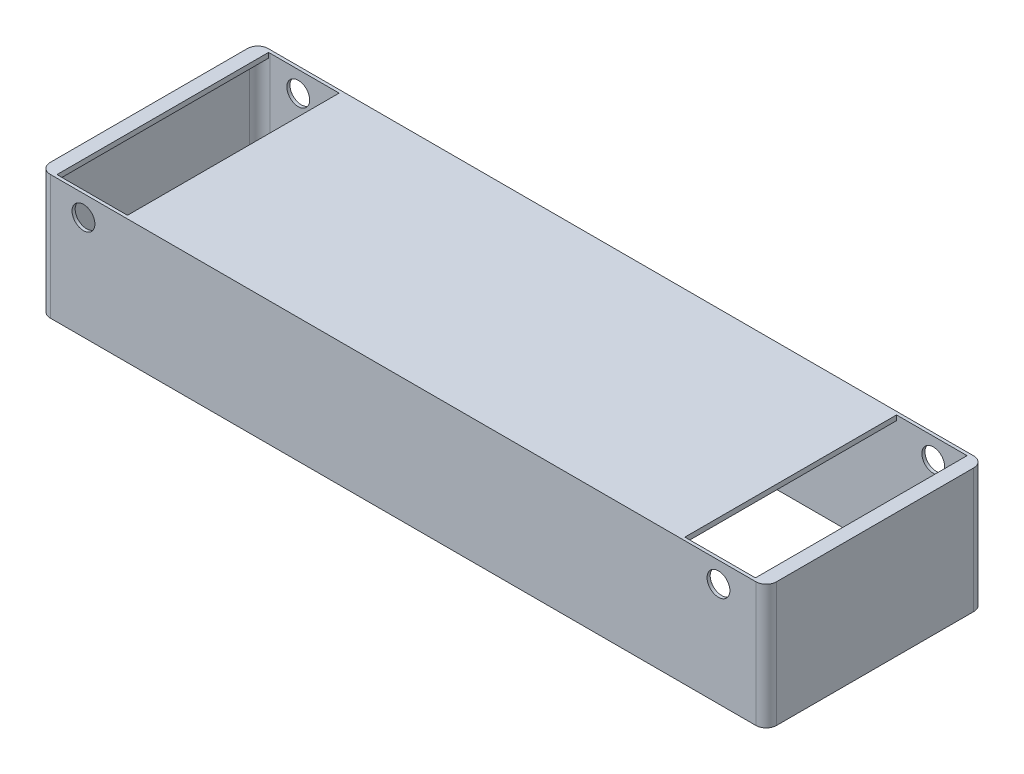
ISO-10303-21;
HEADER;
FILE_DESCRIPTION(('STEP AP214'),'2;1');
FILE_NAME('part.step','',(''),(''),'','','');
FILE_SCHEMA(('AUTOMOTIVE_DESIGN { 1 0 10303 214 1 1 1 1 }'));
ENDSEC;
DATA;
#1=APPLICATION_CONTEXT('core data for automotive mechanical design processes');
#2=APPLICATION_PROTOCOL_DEFINITION('international standard','automotive_design',2000,#1);
#3=PRODUCT_CONTEXT('',#1,'mechanical');
#4=PRODUCT('Part','Part','',(#3));
#5=PRODUCT_RELATED_PRODUCT_CATEGORY('part','',(#4));
#6=PRODUCT_DEFINITION_FORMATION('','',#4);
#7=PRODUCT_DEFINITION_CONTEXT('part definition',#1,'design');
#8=PRODUCT_DEFINITION('design','',#6,#7);
#9=PRODUCT_DEFINITION_SHAPE('','',#8);
#10=(LENGTH_UNIT() NAMED_UNIT(*) SI_UNIT(.MILLI.,.METRE.));
#11=(NAMED_UNIT(*) PLANE_ANGLE_UNIT() SI_UNIT($,.RADIAN.));
#12=(NAMED_UNIT(*) SI_UNIT($,.STERADIAN.) SOLID_ANGLE_UNIT());
#13=UNCERTAINTY_MEASURE_WITH_UNIT(LENGTH_MEASURE(1.E-05),#10,'distance_accuracy_value','');
#14=(GEOMETRIC_REPRESENTATION_CONTEXT(3) GLOBAL_UNCERTAINTY_ASSIGNED_CONTEXT((#13)) GLOBAL_UNIT_ASSIGNED_CONTEXT((#10,
#11,#12)) REPRESENTATION_CONTEXT('',''));
#15=CARTESIAN_POINT('',(0.,0.,0.));
#16=DIRECTION('',(0.,0.,1.));
#17=DIRECTION('',(1.,0.,0.));
#18=AXIS2_PLACEMENT_3D('',#15,#16,#17);
#19=CARTESIAN_POINT('',(-172.6,60.,-46.));
#20=DIRECTION('',(1.,0.,0.));
#21=DIRECTION('',(0.,0.,-1.));
#22=AXIS2_PLACEMENT_3D('',#19,#20,#21);
#23=PLANE('',#22);
#24=DIRECTION('',(0.,-1.,0.));
#25=VECTOR('',#24,1.);
#26=CARTESIAN_POINT('',(-172.6,60.,-46.));
#27=LINE('',#26,#25);
#28=CARTESIAN_POINT('',(-172.6,57.6,-46.));
#29=VERTEX_POINT('',#28);
#30=CARTESIAN_POINT('',(-172.6,0.,-46.));
#31=VERTEX_POINT('',#30);
#32=EDGE_CURVE('E299',#29,#31,#27,.T.);
#33=ORIENTED_EDGE('',*,*,#32,.F.);
#34=DIRECTION('',(0.,0.,1.));
#35=VECTOR('',#34,1.);
#36=CARTESIAN_POINT('',(-172.6,57.6,-46.));
#37=LINE('',#36,#35);
#38=CARTESIAN_POINT('',(-172.6,57.6,45.9999999999999));
#39=VERTEX_POINT('',#38);
#40=EDGE_CURVE('E251',#29,#39,#37,.T.);
#41=ORIENTED_EDGE('',*,*,#40,.T.);
#42=DIRECTION('',(0.,-1.,0.));
#43=VECTOR('',#42,1.);
#44=CARTESIAN_POINT('',(-172.6,60.,45.9999999999999));
#45=LINE('',#44,#43);
#46=CARTESIAN_POINT('',(-172.6,0.,45.9999999999999));
#47=VERTEX_POINT('',#46);
#48=EDGE_CURVE('E297',#39,#47,#45,.T.);
#49=ORIENTED_EDGE('',*,*,#48,.T.);
#50=DIRECTION('',(0.,0.,1.));
#51=VECTOR('',#50,1.);
#52=CARTESIAN_POINT('',(-172.6,0.,-46.));
#53=LINE('',#52,#51);
#54=EDGE_CURVE('E286',#31,#47,#53,.T.);
#55=ORIENTED_EDGE('',*,*,#54,.F.);
#56=EDGE_LOOP('',(#33,#41,#49,#55));
#57=FACE_BOUND('',#56,.T.);
#58=ADVANCED_FACE('F33',(#57),#23,.T.);
#59=CARTESIAN_POINT('',(170.,60.,47.5));
#60=DIRECTION('',(0.,1.,0.));
#61=DIRECTION('',(0.,0.,1.));
#62=AXIS2_PLACEMENT_3D('',#59,#60,#61);
#63=PLANE('',#62);
#64=DIRECTION('',(1.,0.,0.));
#65=VECTOR('',#64,1.);
#66=CARTESIAN_POINT('',(-167.6,60.,51.));
#67=LINE('',#66,#65);
#68=CARTESIAN_POINT('',(134.3,60.,51.));
#69=VERTEX_POINT('',#68);
#70=CARTESIAN_POINT('',(167.6,60.,51.));
#71=VERTEX_POINT('',#70);
#72=EDGE_CURVE('E195',#69,#71,#67,.T.);
#73=ORIENTED_EDGE('',*,*,#72,.F.);
#74=DIRECTION('',(0.,0.,-1.));
#75=VECTOR('',#74,1.);
#76=CARTESIAN_POINT('',(134.3,60.,-52.5));
#77=LINE('',#76,#75);
#78=CARTESIAN_POINT('',(134.3,60.,-51.));
#79=VERTEX_POINT('',#78);
#80=EDGE_CURVE('E201',#69,#79,#77,.T.);
#81=ORIENTED_EDGE('',*,*,#80,.T.);
#82=DIRECTION('',(-1.,0.,0.));
#83=VECTOR('',#82,1.);
#84=CARTESIAN_POINT('',(-167.6,60.,-51.));
#85=LINE('',#84,#83);
#86=CARTESIAN_POINT('',(167.6,60.,-51.));
#87=VERTEX_POINT('',#86);
#88=EDGE_CURVE('E266',#87,#79,#85,.T.);
#89=ORIENTED_EDGE('',*,*,#88,.F.);
#90=CARTESIAN_POINT('',(167.6,60.,-46.));
#91=DIRECTION('',(0.,1.,0.));
#92=DIRECTION('',(0.,0.,-1.));
#93=AXIS2_PLACEMENT_3D('',#90,#91,#92);
#94=CIRCLE('',#93,5.);
#95=CARTESIAN_POINT('',(168.3,60.,-50.9507575177946));
#96=VERTEX_POINT('',#95);
#97=EDGE_CURVE('E262',#96,#87,#94,.T.);
#98=ORIENTED_EDGE('',*,*,#97,.F.);
#99=DIRECTION('',(0.,0.,1.));
#100=VECTOR('',#99,1.);
#101=CARTESIAN_POINT('',(168.3,60.,-52.4999999999991));
#102=LINE('',#101,#100);
#103=CARTESIAN_POINT('',(168.3,60.,50.9507575177947));
#104=VERTEX_POINT('',#103);
#105=EDGE_CURVE('E233',#96,#104,#102,.T.);
#106=ORIENTED_EDGE('',*,*,#105,.T.);
#107=CARTESIAN_POINT('',(167.6,60.,46.));
#108=DIRECTION('',(0.,1.,0.));
#109=DIRECTION('',(0.,0.,1.));
#110=AXIS2_PLACEMENT_3D('',#107,#108,#109);
#111=CIRCLE('',#110,5.);
#112=EDGE_CURVE('E203',#71,#104,#111,.T.);
#113=ORIENTED_EDGE('',*,*,#112,.F.);
#114=EDGE_LOOP('',(#73,#81,#89,#98,#106,#113));
#115=FACE_BOUND('',#114,.T.);
#116=CARTESIAN_POINT('',(-134.3,60.,-51.));
#117=VERTEX_POINT('',#116);
#118=CARTESIAN_POINT('',(-167.6,60.,-51.));
#119=VERTEX_POINT('',#118);
#120=EDGE_CURVE('E265',#117,#119,#85,.T.);
#121=ORIENTED_EDGE('',*,*,#120,.F.);
#122=DIRECTION('',(0.,0.,1.));
#123=VECTOR('',#122,1.);
#124=CARTESIAN_POINT('',(-134.3,60.,-52.5));
#125=LINE('',#124,#123);
#126=CARTESIAN_POINT('',(-134.3,60.,51.));
#127=VERTEX_POINT('',#126);
#128=EDGE_CURVE('E217',#117,#127,#125,.T.);
#129=ORIENTED_EDGE('',*,*,#128,.T.);
#130=CARTESIAN_POINT('',(-167.6,60.,51.));
#131=VERTEX_POINT('',#130);
#132=EDGE_CURVE('E207',#131,#127,#67,.T.);
#133=ORIENTED_EDGE('',*,*,#132,.F.);
#134=CARTESIAN_POINT('',(-167.6,60.,46.));
#135=DIRECTION('',(0.,1.,0.));
#136=DIRECTION('',(0.,0.,1.));
#137=AXIS2_PLACEMENT_3D('',#134,#135,#136);
#138=CIRCLE('',#137,5.);
#139=CARTESIAN_POINT('',(-168.3,60.,50.9507575177946));
#140=VERTEX_POINT('',#139);
#141=EDGE_CURVE('E208',#140,#131,#138,.T.);
#142=ORIENTED_EDGE('',*,*,#141,.F.);
#143=DIRECTION('',(0.,0.,-1.));
#144=VECTOR('',#143,1.);
#145=CARTESIAN_POINT('',(-168.3,60.,-52.5));
#146=LINE('',#145,#144);
#147=CARTESIAN_POINT('',(-168.3,60.,-50.9507575177946));
#148=VERTEX_POINT('',#147);
#149=EDGE_CURVE('E247',#140,#148,#146,.T.);
#150=ORIENTED_EDGE('',*,*,#149,.T.);
#151=CARTESIAN_POINT('',(-167.6,60.,-46.));
#152=DIRECTION('',(0.,1.,0.));
#153=DIRECTION('',(0.,0.,1.));
#154=AXIS2_PLACEMENT_3D('',#151,#152,#153);
#155=CIRCLE('',#154,5.);
#156=EDGE_CURVE('E268',#119,#148,#155,.T.);
#157=ORIENTED_EDGE('',*,*,#156,.F.);
#158=EDGE_LOOP('',(#121,#129,#133,#142,#150,#157));
#159=FACE_BOUND('',#158,.T.);
#160=DIRECTION('',(-1.,0.,0.));
#161=VECTOR('',#160,1.);
#162=CARTESIAN_POINT('',(-170.,60.,-52.5));
#163=LINE('',#162,#161);
#164=CARTESIAN_POINT('',(170.,60.,-52.5));
#165=VERTEX_POINT('',#164);
#166=CARTESIAN_POINT('',(-170.,60.,-52.5));
#167=VERTEX_POINT('',#166);
#168=EDGE_CURVE('E318',#165,#167,#163,.T.);
#169=ORIENTED_EDGE('',*,*,#168,.T.);
#170=CARTESIAN_POINT('',(-170.,60.,-47.5));
#171=DIRECTION('',(0.,1.,0.));
#172=DIRECTION('',(0.,0.,1.));
#173=AXIS2_PLACEMENT_3D('',#170,#171,#172);
#174=CIRCLE('',#173,5.);
#175=CARTESIAN_POINT('',(-175.,60.,-47.5));
#176=VERTEX_POINT('',#175);
#177=EDGE_CURVE('E320',#167,#176,#174,.T.);
#178=ORIENTED_EDGE('',*,*,#177,.T.);
#179=DIRECTION('',(0.,0.,1.));
#180=VECTOR('',#179,1.);
#181=CARTESIAN_POINT('',(-175.,60.,-47.5));
#182=LINE('',#181,#180);
#183=CARTESIAN_POINT('',(-175.,60.,47.4999999999999));
#184=VERTEX_POINT('',#183);
#185=EDGE_CURVE('E322',#176,#184,#182,.T.);
#186=ORIENTED_EDGE('',*,*,#185,.T.);
#187=CARTESIAN_POINT('',(-170.,60.,47.5));
#188=DIRECTION('',(0.,1.,0.));
#189=DIRECTION('',(0.,0.,1.));
#190=AXIS2_PLACEMENT_3D('',#187,#188,#189);
#191=CIRCLE('',#190,5.);
#192=CARTESIAN_POINT('',(-170.,60.,52.5));
#193=VERTEX_POINT('',#192);
#194=EDGE_CURVE('E324',#184,#193,#191,.T.);
#195=ORIENTED_EDGE('',*,*,#194,.T.);
#196=DIRECTION('',(1.,0.,0.));
#197=VECTOR('',#196,1.);
#198=CARTESIAN_POINT('',(-170.,60.,52.5));
#199=LINE('',#198,#197);
#200=CARTESIAN_POINT('',(170.,60.,52.5));
#201=VERTEX_POINT('',#200);
#202=EDGE_CURVE('E326',#193,#201,#199,.T.);
#203=ORIENTED_EDGE('',*,*,#202,.T.);
#204=CARTESIAN_POINT('',(170.,60.,47.5));
#205=DIRECTION('',(0.,1.,0.));
#206=DIRECTION('',(0.,0.,1.));
#207=AXIS2_PLACEMENT_3D('',#204,#205,#206);
#208=CIRCLE('',#207,5.);
#209=CARTESIAN_POINT('',(175.,60.,47.4999999999999));
#210=VERTEX_POINT('',#209);
#211=EDGE_CURVE('E310',#201,#210,#208,.T.);
#212=ORIENTED_EDGE('',*,*,#211,.T.);
#213=DIRECTION('',(0.,0.,-1.));
#214=VECTOR('',#213,1.);
#215=CARTESIAN_POINT('',(175.,60.,-47.5));
#216=LINE('',#215,#214);
#217=CARTESIAN_POINT('',(175.,60.,-47.5));
#218=VERTEX_POINT('',#217);
#219=EDGE_CURVE('E313',#210,#218,#216,.T.);
#220=ORIENTED_EDGE('',*,*,#219,.T.);
#221=CARTESIAN_POINT('',(170.,60.,-47.5));
#222=DIRECTION('',(0.,1.,0.));
#223=DIRECTION('',(0.,0.,-1.));
#224=AXIS2_PLACEMENT_3D('',#221,#222,#223);
#225=CIRCLE('',#224,5.);
#226=EDGE_CURVE('E316',#218,#165,#225,.T.);
#227=ORIENTED_EDGE('',*,*,#226,.T.);
#228=EDGE_LOOP('',(#169,#178,#186,#195,#203,#212,#220,#227));
#229=FACE_BOUND('',#228,.T.);
#230=ADVANCED_FACE('F197',(#115,#159,#229),#63,.T.);
#231=CARTESIAN_POINT('',(170.,0.,47.5));
#232=DIRECTION('',(0.,1.,0.));
#233=DIRECTION('',(0.,0.,1.));
#234=AXIS2_PLACEMENT_3D('',#231,#232,#233);
#235=PLANE('',#234);
#236=CARTESIAN_POINT('',(170.,0.,47.5));
#237=DIRECTION('',(0.,1.,0.));
#238=DIRECTION('',(0.,0.,1.));
#239=AXIS2_PLACEMENT_3D('',#236,#237,#238);
#240=CIRCLE('',#239,5.);
#241=CARTESIAN_POINT('',(170.,0.,52.5));
#242=VERTEX_POINT('',#241);
#243=CARTESIAN_POINT('',(175.,0.,47.4999999999999));
#244=VERTEX_POINT('',#243);
#245=EDGE_CURVE('E309',#242,#244,#240,.T.);
#246=ORIENTED_EDGE('',*,*,#245,.F.);
#247=DIRECTION('',(1.,0.,0.));
#248=VECTOR('',#247,1.);
#249=CARTESIAN_POINT('',(-170.,0.,52.5));
#250=LINE('',#249,#248);
#251=CARTESIAN_POINT('',(-170.,0.,52.5));
#252=VERTEX_POINT('',#251);
#253=EDGE_CURVE('E314',#252,#242,#250,.T.);
#254=ORIENTED_EDGE('',*,*,#253,.F.);
#255=CARTESIAN_POINT('',(-170.,0.,47.5));
#256=DIRECTION('',(0.,1.,0.));
#257=DIRECTION('',(0.,0.,1.));
#258=AXIS2_PLACEMENT_3D('',#255,#256,#257);
#259=CIRCLE('',#258,5.);
#260=CARTESIAN_POINT('',(-175.,0.,47.4999999999999));
#261=VERTEX_POINT('',#260);
#262=EDGE_CURVE('E346',#261,#252,#259,.T.);
#263=ORIENTED_EDGE('',*,*,#262,.F.);
#264=DIRECTION('',(0.,0.,1.));
#265=VECTOR('',#264,1.);
#266=CARTESIAN_POINT('',(-175.,0.,-47.5));
#267=LINE('',#266,#265);
#268=CARTESIAN_POINT('',(-175.,0.,-47.5));
#269=VERTEX_POINT('',#268);
#270=EDGE_CURVE('E343',#269,#261,#267,.T.);
#271=ORIENTED_EDGE('',*,*,#270,.F.);
#272=CARTESIAN_POINT('',(-170.,0.,-47.5));
#273=DIRECTION('',(0.,1.,0.));
#274=DIRECTION('',(0.,0.,1.));
#275=AXIS2_PLACEMENT_3D('',#272,#273,#274);
#276=CIRCLE('',#275,5.);
#277=CARTESIAN_POINT('',(-170.,0.,-52.5));
#278=VERTEX_POINT('',#277);
#279=EDGE_CURVE('E340',#278,#269,#276,.T.);
#280=ORIENTED_EDGE('',*,*,#279,.F.);
#281=DIRECTION('',(-1.,0.,0.));
#282=VECTOR('',#281,1.);
#283=CARTESIAN_POINT('',(-170.,0.,-52.5));
#284=LINE('',#283,#282);
#285=CARTESIAN_POINT('',(170.,0.,-52.5));
#286=VERTEX_POINT('',#285);
#287=EDGE_CURVE('E337',#286,#278,#284,.T.);
#288=ORIENTED_EDGE('',*,*,#287,.F.);
#289=CARTESIAN_POINT('',(170.,0.,-47.5));
#290=DIRECTION('',(0.,1.,0.));
#291=DIRECTION('',(0.,0.,-1.));
#292=AXIS2_PLACEMENT_3D('',#289,#290,#291);
#293=CIRCLE('',#292,5.);
#294=CARTESIAN_POINT('',(175.,0.,-47.5));
#295=VERTEX_POINT('',#294);
#296=EDGE_CURVE('E334',#295,#286,#293,.T.);
#297=ORIENTED_EDGE('',*,*,#296,.F.);
#298=DIRECTION('',(0.,0.,-1.));
#299=VECTOR('',#298,1.);
#300=CARTESIAN_POINT('',(175.,0.,-47.5));
#301=LINE('',#300,#299);
#302=EDGE_CURVE('E331',#244,#295,#301,.T.);
#303=ORIENTED_EDGE('',*,*,#302,.F.);
#304=EDGE_LOOP('',(#246,#254,#263,#271,#280,#288,#297,#303));
#305=FACE_BOUND('',#304,.T.);
#306=CARTESIAN_POINT('',(167.6,0.,46.));
#307=DIRECTION('',(0.,1.,0.));
#308=DIRECTION('',(0.,0.,1.));
#309=AXIS2_PLACEMENT_3D('',#306,#307,#308);
#310=CIRCLE('',#309,5.);
#311=CARTESIAN_POINT('',(167.6,0.,51.));
#312=VERTEX_POINT('',#311);
#313=CARTESIAN_POINT('',(172.6,0.,45.9999999999999));
#314=VERTEX_POINT('',#313);
#315=EDGE_CURVE('E260',#312,#314,#310,.T.);
#316=ORIENTED_EDGE('',*,*,#315,.T.);
#317=DIRECTION('',(0.,0.,-1.));
#318=VECTOR('',#317,1.);
#319=CARTESIAN_POINT('',(172.6,0.,-46.));
#320=LINE('',#319,#318);
#321=CARTESIAN_POINT('',(172.6,0.,-46.));
#322=VERTEX_POINT('',#321);
#323=EDGE_CURVE('E274',#314,#322,#320,.T.);
#324=ORIENTED_EDGE('',*,*,#323,.T.);
#325=CARTESIAN_POINT('',(167.6,0.,-46.));
#326=DIRECTION('',(0.,1.,0.));
#327=DIRECTION('',(0.,0.,-1.));
#328=AXIS2_PLACEMENT_3D('',#325,#326,#327);
#329=CIRCLE('',#328,5.);
#330=CARTESIAN_POINT('',(167.6,0.,-51.));
#331=VERTEX_POINT('',#330);
#332=EDGE_CURVE('E277',#322,#331,#329,.T.);
#333=ORIENTED_EDGE('',*,*,#332,.T.);
#334=DIRECTION('',(-1.,0.,0.));
#335=VECTOR('',#334,1.);
#336=CARTESIAN_POINT('',(-167.6,0.,-51.));
#337=LINE('',#336,#335);
#338=CARTESIAN_POINT('',(-167.6,0.,-51.));
#339=VERTEX_POINT('',#338);
#340=EDGE_CURVE('E280',#331,#339,#337,.T.);
#341=ORIENTED_EDGE('',*,*,#340,.T.);
#342=CARTESIAN_POINT('',(-167.6,0.,-46.));
#343=DIRECTION('',(0.,1.,0.));
#344=DIRECTION('',(0.,0.,1.));
#345=AXIS2_PLACEMENT_3D('',#342,#343,#344);
#346=CIRCLE('',#345,5.);
#347=EDGE_CURVE('E283',#339,#31,#346,.T.);
#348=ORIENTED_EDGE('',*,*,#347,.T.);
#349=ORIENTED_EDGE('',*,*,#54,.T.);
#350=CARTESIAN_POINT('',(-167.6,0.,46.));
#351=DIRECTION('',(0.,1.,0.));
#352=DIRECTION('',(0.,0.,1.));
#353=AXIS2_PLACEMENT_3D('',#350,#351,#352);
#354=CIRCLE('',#353,5.);
#355=CARTESIAN_POINT('',(-167.6,0.,51.));
#356=VERTEX_POINT('',#355);
#357=EDGE_CURVE('E289',#47,#356,#354,.T.);
#358=ORIENTED_EDGE('',*,*,#357,.T.);
#359=DIRECTION('',(1.,0.,0.));
#360=VECTOR('',#359,1.);
#361=CARTESIAN_POINT('',(-167.6,0.,51.));
#362=LINE('',#361,#360);
#363=EDGE_CURVE('E263',#356,#312,#362,.T.);
#364=ORIENTED_EDGE('',*,*,#363,.T.);
#365=EDGE_LOOP('',(#316,#324,#333,#341,#348,#349,#358,#364));
#366=FACE_BOUND('',#365,.T.);
#367=ADVANCED_FACE('F424',(#305,#366),#235,.F.);
#368=CARTESIAN_POINT('',(170.,60.,47.5));
#369=DIRECTION('',(0.,-1.,0.));
#370=DIRECTION('',(0.,0.,-1.));
#371=AXIS2_PLACEMENT_3D('',#368,#369,#370);
#372=CYLINDRICAL_SURFACE('',#371,5.);
#373=ORIENTED_EDGE('',*,*,#245,.T.);
#374=DIRECTION('',(0.,-1.,0.));
#375=VECTOR('',#374,1.);
#376=CARTESIAN_POINT('',(175.,60.,47.4999999999999));
#377=LINE('',#376,#375);
#378=EDGE_CURVE('E364',#210,#244,#377,.T.);
#379=ORIENTED_EDGE('',*,*,#378,.F.);
#380=ORIENTED_EDGE('',*,*,#211,.F.);
#381=DIRECTION('',(0.,-1.,0.));
#382=VECTOR('',#381,1.);
#383=CARTESIAN_POINT('',(170.,60.,52.5));
#384=LINE('',#383,#382);
#385=EDGE_CURVE('E328',#201,#242,#384,.T.);
#386=ORIENTED_EDGE('',*,*,#385,.T.);
#387=EDGE_LOOP('',(#373,#379,#380,#386));
#388=FACE_BOUND('',#387,.T.);
#389=ADVANCED_FACE('F35',(#388),#372,.T.);
#390=CARTESIAN_POINT('',(175.,60.,-47.5));
#391=DIRECTION('',(-1.,0.,0.));
#392=DIRECTION('',(0.,0.,1.));
#393=AXIS2_PLACEMENT_3D('',#390,#391,#392);
#394=PLANE('',#393);
#395=ORIENTED_EDGE('',*,*,#302,.T.);
#396=DIRECTION('',(0.,-1.,0.));
#397=VECTOR('',#396,1.);
#398=CARTESIAN_POINT('',(175.,60.,-47.5));
#399=LINE('',#398,#397);
#400=EDGE_CURVE('E362',#218,#295,#399,.T.);
#401=ORIENTED_EDGE('',*,*,#400,.F.);
#402=ORIENTED_EDGE('',*,*,#219,.F.);
#403=ORIENTED_EDGE('',*,*,#378,.T.);
#404=EDGE_LOOP('',(#395,#401,#402,#403));
#405=FACE_BOUND('',#404,.T.);
#406=ADVANCED_FACE('F475',(#405),#394,.F.);
#407=CARTESIAN_POINT('',(170.,60.,-47.5));
#408=DIRECTION('',(0.,-1.,0.));
#409=DIRECTION('',(0.,0.,-1.));
#410=AXIS2_PLACEMENT_3D('',#407,#408,#409);
#411=CYLINDRICAL_SURFACE('',#410,5.);
#412=ORIENTED_EDGE('',*,*,#296,.T.);
#413=DIRECTION('',(0.,-1.,0.));
#414=VECTOR('',#413,1.);
#415=CARTESIAN_POINT('',(170.,60.,-52.5));
#416=LINE('',#415,#414);
#417=EDGE_CURVE('E360',#165,#286,#416,.T.);
#418=ORIENTED_EDGE('',*,*,#417,.F.);
#419=ORIENTED_EDGE('',*,*,#226,.F.);
#420=ORIENTED_EDGE('',*,*,#400,.T.);
#421=EDGE_LOOP('',(#412,#418,#419,#420));
#422=FACE_BOUND('',#421,.T.);
#423=ADVANCED_FACE('F473',(#422),#411,.T.);
#424=CARTESIAN_POINT('',(-170.,60.,-52.5));
#425=DIRECTION('',(0.,0.,1.));
#426=DIRECTION('',(1.,0.,0.));
#427=AXIS2_PLACEMENT_3D('',#424,#425,#426);
#428=PLANE('',#427);
#429=CARTESIAN_POINT('',(152.,50.,-52.5));
#430=DIRECTION('',(0.,0.,1.));
#431=DIRECTION('',(1.,0.,0.));
#432=AXIS2_PLACEMENT_3D('',#429,#430,#431);
#433=CIRCLE('',#432,5.50000000000002);
#434=CARTESIAN_POINT('',(157.5,50.,-52.5));
#435=VERTEX_POINT('',#434);
#436=EDGE_CURVE('E382',#435,#435,#433,.T.);
#437=ORIENTED_EDGE('',*,*,#436,.T.);
#438=EDGE_LOOP('',(#437));
#439=FACE_BOUND('',#438,.T.);
#440=CARTESIAN_POINT('',(-154.,50.,-52.5));
#441=DIRECTION('',(0.,0.,1.));
#442=DIRECTION('',(1.,0.,0.));
#443=AXIS2_PLACEMENT_3D('',#440,#441,#442);
#444=CIRCLE('',#443,5.50000000000002);
#445=CARTESIAN_POINT('',(-148.5,50.,-52.5));
#446=VERTEX_POINT('',#445);
#447=EDGE_CURVE('E393',#446,#446,#444,.T.);
#448=ORIENTED_EDGE('',*,*,#447,.T.);
#449=EDGE_LOOP('',(#448));
#450=FACE_BOUND('',#449,.T.);
#451=DIRECTION('',(0.,-1.,0.));
#452=VECTOR('',#451,1.);
#453=CARTESIAN_POINT('',(-170.,60.,-52.5));
#454=LINE('',#453,#452);
#455=EDGE_CURVE('E358',#167,#278,#454,.T.);
#456=ORIENTED_EDGE('',*,*,#455,.F.);
#457=ORIENTED_EDGE('',*,*,#168,.F.);
#458=ORIENTED_EDGE('',*,*,#417,.T.);
#459=ORIENTED_EDGE('',*,*,#287,.T.);
#460=EDGE_LOOP('',(#456,#457,#458,#459));
#461=FACE_BOUND('',#460,.T.);
#462=ADVANCED_FACE('F469',(#439,#450,#461),#428,.F.);
#463=CARTESIAN_POINT('',(-170.,60.,-47.5));
#464=DIRECTION('',(0.,-1.,0.));
#465=DIRECTION('',(0.,0.,-1.));
#466=AXIS2_PLACEMENT_3D('',#463,#464,#465);
#467=CYLINDRICAL_SURFACE('',#466,5.);
#468=ORIENTED_EDGE('',*,*,#455,.T.);
#469=ORIENTED_EDGE('',*,*,#279,.T.);
#470=DIRECTION('',(0.,-1.,0.));
#471=VECTOR('',#470,1.);
#472=CARTESIAN_POINT('',(-175.,60.,-47.5));
#473=LINE('',#472,#471);
#474=EDGE_CURVE('E356',#176,#269,#473,.T.);
#475=ORIENTED_EDGE('',*,*,#474,.F.);
#476=ORIENTED_EDGE('',*,*,#177,.F.);
#477=EDGE_LOOP('',(#468,#469,#475,#476));
#478=FACE_BOUND('',#477,.T.);
#479=ADVANCED_FACE('F465',(#478),#467,.T.);
#480=CARTESIAN_POINT('',(-175.,60.,-47.5));
#481=DIRECTION('',(1.,0.,0.));
#482=DIRECTION('',(0.,0.,-1.));
#483=AXIS2_PLACEMENT_3D('',#480,#481,#482);
#484=PLANE('',#483);
#485=ORIENTED_EDGE('',*,*,#474,.T.);
#486=ORIENTED_EDGE('',*,*,#270,.T.);
#487=DIRECTION('',(0.,-1.,0.));
#488=VECTOR('',#487,1.);
#489=CARTESIAN_POINT('',(-175.,60.,47.4999999999999));
#490=LINE('',#489,#488);
#491=EDGE_CURVE('E354',#184,#261,#490,.T.);
#492=ORIENTED_EDGE('',*,*,#491,.F.);
#493=ORIENTED_EDGE('',*,*,#185,.F.);
#494=EDGE_LOOP('',(#485,#486,#492,#493));
#495=FACE_BOUND('',#494,.T.);
#496=ADVANCED_FACE('F461',(#495),#484,.F.);
#497=CARTESIAN_POINT('',(-170.,60.,47.5));
#498=DIRECTION('',(0.,-1.,0.));
#499=DIRECTION('',(0.,0.,-1.));
#500=AXIS2_PLACEMENT_3D('',#497,#498,#499);
#501=CYLINDRICAL_SURFACE('',#500,5.);
#502=ORIENTED_EDGE('',*,*,#491,.T.);
#503=ORIENTED_EDGE('',*,*,#262,.T.);
#504=DIRECTION('',(0.,-1.,0.));
#505=VECTOR('',#504,1.);
#506=CARTESIAN_POINT('',(-170.,60.,52.5));
#507=LINE('',#506,#505);
#508=EDGE_CURVE('E352',#193,#252,#507,.T.);
#509=ORIENTED_EDGE('',*,*,#508,.F.);
#510=ORIENTED_EDGE('',*,*,#194,.F.);
#511=EDGE_LOOP('',(#502,#503,#509,#510));
#512=FACE_BOUND('',#511,.T.);
#513=ADVANCED_FACE('F457',(#512),#501,.T.);
#514=CARTESIAN_POINT('',(-170.,60.,52.5));
#515=DIRECTION('',(0.,0.,-1.));
#516=DIRECTION('',(-1.,0.,0.));
#517=AXIS2_PLACEMENT_3D('',#514,#515,#516);
#518=PLANE('',#517);
#519=CARTESIAN_POINT('',(152.,50.,52.5));
#520=DIRECTION('',(0.,0.,1.));
#521=DIRECTION('',(1.,0.,0.));
#522=AXIS2_PLACEMENT_3D('',#519,#520,#521);
#523=CIRCLE('',#522,5.50000000000002);
#524=CARTESIAN_POINT('',(157.5,50.,52.5));
#525=VERTEX_POINT('',#524);
#526=EDGE_CURVE('E388',#525,#525,#523,.T.);
#527=ORIENTED_EDGE('',*,*,#526,.F.);
#528=EDGE_LOOP('',(#527));
#529=FACE_BOUND('',#528,.T.);
#530=CARTESIAN_POINT('',(-154.,50.,52.5));
#531=DIRECTION('',(0.,0.,1.));
#532=DIRECTION('',(1.,0.,0.));
#533=AXIS2_PLACEMENT_3D('',#530,#531,#532);
#534=CIRCLE('',#533,5.50000000000002);
#535=CARTESIAN_POINT('',(-148.5,50.,52.5));
#536=VERTEX_POINT('',#535);
#537=EDGE_CURVE('E398',#536,#536,#534,.T.);
#538=ORIENTED_EDGE('',*,*,#537,.F.);
#539=EDGE_LOOP('',(#538));
#540=FACE_BOUND('',#539,.T.);
#541=ORIENTED_EDGE('',*,*,#385,.F.);
#542=ORIENTED_EDGE('',*,*,#202,.F.);
#543=ORIENTED_EDGE('',*,*,#508,.T.);
#544=ORIENTED_EDGE('',*,*,#253,.T.);
#545=EDGE_LOOP('',(#541,#542,#543,#544));
#546=FACE_BOUND('',#545,.T.);
#547=ADVANCED_FACE('F449',(#529,#540,#546),#518,.F.);
#548=CARTESIAN_POINT('',(167.6,60.,46.));
#549=DIRECTION('',(0.,-1.,0.));
#550=DIRECTION('',(0.,0.,-1.));
#551=AXIS2_PLACEMENT_3D('',#548,#549,#550);
#552=CYLINDRICAL_SURFACE('',#551,5.);
#553=DIRECTION('',(0.,-1.,0.));
#554=VECTOR('',#553,1.);
#555=CARTESIAN_POINT('',(168.3,60.,50.9507575177947));
#556=LINE('',#555,#554);
#557=CARTESIAN_POINT('',(168.3,57.6,50.9507575177947));
#558=VERTEX_POINT('',#557);
#559=EDGE_CURVE('E244',#558,#104,#556,.F.);
#560=ORIENTED_EDGE('',*,*,#559,.F.);
#561=CARTESIAN_POINT('',(167.6,57.6,46.));
#562=DIRECTION('',(0.,-1.,0.));
#563=DIRECTION('',(0.,0.,-1.));
#564=AXIS2_PLACEMENT_3D('',#561,#562,#563);
#565=CIRCLE('',#564,5.);
#566=CARTESIAN_POINT('',(172.6,57.6,45.9999999999999));
#567=VERTEX_POINT('',#566);
#568=EDGE_CURVE('E241',#567,#558,#565,.T.);
#569=ORIENTED_EDGE('',*,*,#568,.F.);
#570=DIRECTION('',(0.,-1.,0.));
#571=VECTOR('',#570,1.);
#572=CARTESIAN_POINT('',(172.6,60.,45.9999999999999));
#573=LINE('',#572,#571);
#574=EDGE_CURVE('E307',#567,#314,#573,.T.);
#575=ORIENTED_EDGE('',*,*,#574,.T.);
#576=ORIENTED_EDGE('',*,*,#315,.F.);
#577=DIRECTION('',(0.,-1.,0.));
#578=VECTOR('',#577,1.);
#579=CARTESIAN_POINT('',(167.6,60.,51.));
#580=LINE('',#579,#578);
#581=EDGE_CURVE('E271',#71,#312,#580,.T.);
#582=ORIENTED_EDGE('',*,*,#581,.F.);
#583=ORIENTED_EDGE('',*,*,#112,.T.);
#584=EDGE_LOOP('',(#560,#569,#575,#576,#582,#583));
#585=FACE_BOUND('',#584,.T.);
#586=ADVANCED_FACE('F446',(#585),#552,.F.);
#587=CARTESIAN_POINT('',(172.6,60.,-46.));
#588=DIRECTION('',(-1.,0.,0.));
#589=DIRECTION('',(0.,0.,1.));
#590=AXIS2_PLACEMENT_3D('',#587,#588,#589);
#591=PLANE('',#590);
#592=DIRECTION('',(0.,0.,1.));
#593=VECTOR('',#592,1.);
#594=CARTESIAN_POINT('',(172.6,57.6,-46.));
#595=LINE('',#594,#593);
#596=CARTESIAN_POINT('',(172.6,57.6,-46.));
#597=VERTEX_POINT('',#596);
#598=EDGE_CURVE('E237',#597,#567,#595,.T.);
#599=ORIENTED_EDGE('',*,*,#598,.F.);
#600=DIRECTION('',(0.,-1.,0.));
#601=VECTOR('',#600,1.);
#602=CARTESIAN_POINT('',(172.6,60.,-46.));
#603=LINE('',#602,#601);
#604=EDGE_CURVE('E305',#597,#322,#603,.T.);
#605=ORIENTED_EDGE('',*,*,#604,.T.);
#606=ORIENTED_EDGE('',*,*,#323,.F.);
#607=ORIENTED_EDGE('',*,*,#574,.F.);
#608=EDGE_LOOP('',(#599,#605,#606,#607));
#609=FACE_BOUND('',#608,.T.);
#610=ADVANCED_FACE('F442',(#609),#591,.T.);
#611=CARTESIAN_POINT('',(167.6,60.,-46.));
#612=DIRECTION('',(0.,-1.,0.));
#613=DIRECTION('',(0.,0.,-1.));
#614=AXIS2_PLACEMENT_3D('',#611,#612,#613);
#615=CYLINDRICAL_SURFACE('',#614,5.);
#616=DIRECTION('',(0.,-1.,0.));
#617=VECTOR('',#616,1.);
#618=CARTESIAN_POINT('',(168.3,60.,-50.9507575177946));
#619=LINE('',#618,#617);
#620=CARTESIAN_POINT('',(168.3,57.6,-50.9507575177946));
#621=VERTEX_POINT('',#620);
#622=EDGE_CURVE('E374',#96,#621,#619,.T.);
#623=ORIENTED_EDGE('',*,*,#622,.F.);
#624=ORIENTED_EDGE('',*,*,#97,.T.);
#625=DIRECTION('',(0.,-1.,0.));
#626=VECTOR('',#625,1.);
#627=CARTESIAN_POINT('',(167.6,60.,-51.));
#628=LINE('',#627,#626);
#629=EDGE_CURVE('E303',#87,#331,#628,.T.);
#630=ORIENTED_EDGE('',*,*,#629,.T.);
#631=ORIENTED_EDGE('',*,*,#332,.F.);
#632=ORIENTED_EDGE('',*,*,#604,.F.);
#633=CARTESIAN_POINT('',(167.6,57.6,-46.));
#634=DIRECTION('',(0.,-1.,0.));
#635=DIRECTION('',(0.,0.,-1.));
#636=AXIS2_PLACEMENT_3D('',#633,#634,#635);
#637=CIRCLE('',#636,5.);
#638=EDGE_CURVE('E371',#621,#597,#637,.T.);
#639=ORIENTED_EDGE('',*,*,#638,.F.);
#640=EDGE_LOOP('',(#623,#624,#630,#631,#632,#639));
#641=FACE_BOUND('',#640,.T.);
#642=ADVANCED_FACE('F438',(#641),#615,.F.);
#643=CARTESIAN_POINT('',(-167.6,60.,-51.));
#644=DIRECTION('',(0.,0.,1.));
#645=DIRECTION('',(1.,0.,0.));
#646=AXIS2_PLACEMENT_3D('',#643,#644,#645);
#647=PLANE('',#646);
#648=CARTESIAN_POINT('',(152.,50.,-51.));
#649=DIRECTION('',(0.,0.,1.));
#650=DIRECTION('',(1.,0.,0.));
#651=AXIS2_PLACEMENT_3D('',#648,#649,#650);
#652=CIRCLE('',#651,5.50000000000002);
#653=CARTESIAN_POINT('',(157.5,50.,-51.));
#654=VERTEX_POINT('',#653);
#655=EDGE_CURVE('E218',#654,#654,#652,.T.);
#656=ORIENTED_EDGE('',*,*,#655,.F.);
#657=EDGE_LOOP('',(#656));
#658=FACE_BOUND('',#657,.T.);
#659=CARTESIAN_POINT('',(-154.,50.,-51.));
#660=DIRECTION('',(0.,0.,1.));
#661=DIRECTION('',(1.,0.,0.));
#662=AXIS2_PLACEMENT_3D('',#659,#660,#661);
#663=CIRCLE('',#662,5.50000000000002);
#664=CARTESIAN_POINT('',(-148.5,50.,-51.));
#665=VERTEX_POINT('',#664);
#666=EDGE_CURVE('E381',#665,#665,#663,.T.);
#667=ORIENTED_EDGE('',*,*,#666,.F.);
#668=EDGE_LOOP('',(#667));
#669=FACE_BOUND('',#668,.T.);
#670=DIRECTION('',(0.,1.,0.));
#671=VECTOR('',#670,1.);
#672=CARTESIAN_POINT('',(134.3,60.,-51.));
#673=LINE('',#672,#671);
#674=CARTESIAN_POINT('',(134.3,57.6,-51.));
#675=VERTEX_POINT('',#674);
#676=EDGE_CURVE('E55',#675,#79,#673,.T.);
#677=ORIENTED_EDGE('',*,*,#676,.F.);
#678=DIRECTION('',(-1.,0.,0.));
#679=VECTOR('',#678,1.);
#680=CARTESIAN_POINT('',(-167.6,57.6,-51.));
#681=LINE('',#680,#679);
#682=CARTESIAN_POINT('',(-134.3,57.6,-51.));
#683=VERTEX_POINT('',#682);
#684=EDGE_CURVE('E50',#675,#683,#681,.T.);
#685=ORIENTED_EDGE('',*,*,#684,.T.);
#686=DIRECTION('',(0.,-1.,0.));
#687=VECTOR('',#686,1.);
#688=CARTESIAN_POINT('',(-134.3,60.,-51.));
#689=LINE('',#688,#687);
#690=EDGE_CURVE('E230',#117,#683,#689,.T.);
#691=ORIENTED_EDGE('',*,*,#690,.F.);
#692=ORIENTED_EDGE('',*,*,#120,.T.);
#693=DIRECTION('',(0.,-1.,0.));
#694=VECTOR('',#693,1.);
#695=CARTESIAN_POINT('',(-167.6,60.,-51.));
#696=LINE('',#695,#694);
#697=EDGE_CURVE('E301',#119,#339,#696,.T.);
#698=ORIENTED_EDGE('',*,*,#697,.T.);
#699=ORIENTED_EDGE('',*,*,#340,.F.);
#700=ORIENTED_EDGE('',*,*,#629,.F.);
#701=ORIENTED_EDGE('',*,*,#88,.T.);
#702=EDGE_LOOP('',(#677,#685,#691,#692,#698,#699,#700,#701));
#703=FACE_BOUND('',#702,.T.);
#704=ADVANCED_FACE('F434',(#658,#669,#703),#647,.T.);
#705=CARTESIAN_POINT('',(-167.6,60.,-46.));
#706=DIRECTION('',(0.,-1.,0.));
#707=DIRECTION('',(0.,0.,-1.));
#708=AXIS2_PLACEMENT_3D('',#705,#706,#707);
#709=CYLINDRICAL_SURFACE('',#708,5.);
#710=DIRECTION('',(0.,-1.,0.));
#711=VECTOR('',#710,1.);
#712=CARTESIAN_POINT('',(-168.3,60.,-50.9507575177946));
#713=LINE('',#712,#711);
#714=CARTESIAN_POINT('',(-168.3,57.6,-50.9507575177946));
#715=VERTEX_POINT('',#714);
#716=EDGE_CURVE('E257',#715,#148,#713,.F.);
#717=ORIENTED_EDGE('',*,*,#716,.F.);
#718=CARTESIAN_POINT('',(-167.6,57.6,-46.));
#719=DIRECTION('',(0.,1.,0.));
#720=DIRECTION('',(0.,0.,1.));
#721=AXIS2_PLACEMENT_3D('',#718,#719,#720);
#722=CIRCLE('',#721,5.);
#723=EDGE_CURVE('E255',#715,#29,#722,.T.);
#724=ORIENTED_EDGE('',*,*,#723,.T.);
#725=ORIENTED_EDGE('',*,*,#32,.T.);
#726=ORIENTED_EDGE('',*,*,#347,.F.);
#727=ORIENTED_EDGE('',*,*,#697,.F.);
#728=ORIENTED_EDGE('',*,*,#156,.T.);
#729=EDGE_LOOP('',(#717,#724,#725,#726,#727,#728));
#730=FACE_BOUND('',#729,.T.);
#731=ADVANCED_FACE('F431',(#730),#709,.F.);
#732=CARTESIAN_POINT('',(-167.6,60.,46.));
#733=DIRECTION('',(0.,-1.,0.));
#734=DIRECTION('',(0.,0.,-1.));
#735=AXIS2_PLACEMENT_3D('',#732,#733,#734);
#736=CYLINDRICAL_SURFACE('',#735,5.);
#737=DIRECTION('',(0.,-1.,0.));
#738=VECTOR('',#737,1.);
#739=CARTESIAN_POINT('',(-168.3,60.,50.9507575177946));
#740=LINE('',#739,#738);
#741=CARTESIAN_POINT('',(-168.3,57.6,50.9507575177946));
#742=VERTEX_POINT('',#741);
#743=EDGE_CURVE('E368',#140,#742,#740,.T.);
#744=ORIENTED_EDGE('',*,*,#743,.F.);
#745=ORIENTED_EDGE('',*,*,#141,.T.);
#746=DIRECTION('',(0.,-1.,0.));
#747=VECTOR('',#746,1.);
#748=CARTESIAN_POINT('',(-167.6,60.,51.));
#749=LINE('',#748,#747);
#750=EDGE_CURVE('E295',#131,#356,#749,.T.);
#751=ORIENTED_EDGE('',*,*,#750,.T.);
#752=ORIENTED_EDGE('',*,*,#357,.F.);
#753=ORIENTED_EDGE('',*,*,#48,.F.);
#754=CARTESIAN_POINT('',(-167.6,57.6,46.));
#755=DIRECTION('',(0.,1.,0.));
#756=DIRECTION('',(0.,0.,1.));
#757=AXIS2_PLACEMENT_3D('',#754,#755,#756);
#758=CIRCLE('',#757,5.);
#759=EDGE_CURVE('E366',#39,#742,#758,.T.);
#760=ORIENTED_EDGE('',*,*,#759,.T.);
#761=EDGE_LOOP('',(#744,#745,#751,#752,#753,#760));
#762=FACE_BOUND('',#761,.T.);
#763=ADVANCED_FACE('F429',(#762),#736,.F.);
#764=CARTESIAN_POINT('',(-167.6,60.,51.));
#765=DIRECTION('',(0.,0.,-1.));
#766=DIRECTION('',(-1.,0.,0.));
#767=AXIS2_PLACEMENT_3D('',#764,#765,#766);
#768=PLANE('',#767);
#769=CARTESIAN_POINT('',(152.,50.,51.));
#770=DIRECTION('',(0.,0.,-1.));
#771=DIRECTION('',(-1.,0.,0.));
#772=AXIS2_PLACEMENT_3D('',#769,#770,#771);
#773=CIRCLE('',#772,5.50000000000002);
#774=CARTESIAN_POINT('',(146.5,50.,51.));
#775=VERTEX_POINT('',#774);
#776=EDGE_CURVE('E37',#775,#775,#773,.T.);
#777=ORIENTED_EDGE('',*,*,#776,.F.);
#778=EDGE_LOOP('',(#777));
#779=FACE_BOUND('',#778,.T.);
#780=CARTESIAN_POINT('',(-154.,50.,51.));
#781=DIRECTION('',(0.,0.,-1.));
#782=DIRECTION('',(-1.,0.,0.));
#783=AXIS2_PLACEMENT_3D('',#780,#781,#782);
#784=CIRCLE('',#783,5.50000000000002);
#785=CARTESIAN_POINT('',(-159.5,50.,51.));
#786=VERTEX_POINT('',#785);
#787=EDGE_CURVE('E379',#786,#786,#784,.T.);
#788=ORIENTED_EDGE('',*,*,#787,.F.);
#789=EDGE_LOOP('',(#788));
#790=FACE_BOUND('',#789,.T.);
#791=DIRECTION('',(0.,-1.,0.));
#792=VECTOR('',#791,1.);
#793=CARTESIAN_POINT('',(134.3,60.,51.));
#794=LINE('',#793,#792);
#795=CARTESIAN_POINT('',(134.3,57.6,51.));
#796=VERTEX_POINT('',#795);
#797=EDGE_CURVE('E11',#69,#796,#794,.T.);
#798=ORIENTED_EDGE('',*,*,#797,.F.);
#799=ORIENTED_EDGE('',*,*,#72,.T.);
#800=ORIENTED_EDGE('',*,*,#581,.T.);
#801=ORIENTED_EDGE('',*,*,#363,.F.);
#802=ORIENTED_EDGE('',*,*,#750,.F.);
#803=ORIENTED_EDGE('',*,*,#132,.T.);
#804=DIRECTION('',(0.,1.,0.));
#805=VECTOR('',#804,1.);
#806=CARTESIAN_POINT('',(-134.3,60.,51.));
#807=LINE('',#806,#805);
#808=CARTESIAN_POINT('',(-134.3,57.6,51.));
#809=VERTEX_POINT('',#808);
#810=EDGE_CURVE('E42',#809,#127,#807,.T.);
#811=ORIENTED_EDGE('',*,*,#810,.F.);
#812=DIRECTION('',(1.,0.,0.));
#813=VECTOR('',#812,1.);
#814=CARTESIAN_POINT('',(-167.6,57.6,51.));
#815=LINE('',#814,#813);
#816=EDGE_CURVE('E212',#809,#796,#815,.T.);
#817=ORIENTED_EDGE('',*,*,#816,.T.);
#818=EDGE_LOOP('',(#798,#799,#800,#801,#802,#803,#811,#817));
#819=FACE_BOUND('',#818,.T.);
#820=ADVANCED_FACE('F210',(#779,#790,#819),#768,.T.);
#821=CARTESIAN_POINT('',(-170.,57.6,47.5));
#822=DIRECTION('',(0.,1.,0.));
#823=DIRECTION('',(0.,0.,1.));
#824=AXIS2_PLACEMENT_3D('',#821,#822,#823);
#825=PLANE('',#824);
#826=ORIENTED_EDGE('',*,*,#723,.F.);
#827=DIRECTION('',(0.,0.,-1.));
#828=VECTOR('',#827,1.);
#829=CARTESIAN_POINT('',(-168.3,57.6,-52.5));
#830=LINE('',#829,#828);
#831=EDGE_CURVE('E248',#742,#715,#830,.T.);
#832=ORIENTED_EDGE('',*,*,#831,.F.);
#833=ORIENTED_EDGE('',*,*,#759,.F.);
#834=ORIENTED_EDGE('',*,*,#40,.F.);
#835=EDGE_LOOP('',(#826,#832,#833,#834));
#836=FACE_BOUND('',#835,.T.);
#837=ADVANCED_FACE('F544',(#836),#825,.F.);
#838=CARTESIAN_POINT('',(-168.3,57.6,-52.5));
#839=DIRECTION('',(1.,0.,0.));
#840=DIRECTION('',(0.,0.,-1.));
#841=AXIS2_PLACEMENT_3D('',#838,#839,#840);
#842=PLANE('',#841);
#843=ORIENTED_EDGE('',*,*,#831,.T.);
#844=ORIENTED_EDGE('',*,*,#716,.T.);
#845=ORIENTED_EDGE('',*,*,#149,.F.);
#846=ORIENTED_EDGE('',*,*,#743,.T.);
#847=EDGE_LOOP('',(#843,#844,#845,#846));
#848=FACE_BOUND('',#847,.T.);
#849=ADVANCED_FACE('F537',(#848),#842,.T.);
#850=CARTESIAN_POINT('',(170.,57.6,-47.4999999999991));
#851=DIRECTION('',(0.,-1.,0.));
#852=DIRECTION('',(0.,0.,-1.));
#853=AXIS2_PLACEMENT_3D('',#850,#851,#852);
#854=PLANE('',#853);
#855=ORIENTED_EDGE('',*,*,#598,.T.);
#856=ORIENTED_EDGE('',*,*,#568,.T.);
#857=DIRECTION('',(0.,0.,1.));
#858=VECTOR('',#857,1.);
#859=CARTESIAN_POINT('',(168.3,57.6,-52.4999999999991));
#860=LINE('',#859,#858);
#861=EDGE_CURVE('E234',#621,#558,#860,.T.);
#862=ORIENTED_EDGE('',*,*,#861,.F.);
#863=ORIENTED_EDGE('',*,*,#638,.T.);
#864=EDGE_LOOP('',(#855,#856,#862,#863));
#865=FACE_BOUND('',#864,.T.);
#866=ADVANCED_FACE('F535',(#865),#854,.T.);
#867=CARTESIAN_POINT('',(168.3,57.6,-52.4999999999991));
#868=DIRECTION('',(-1.,0.,0.));
#869=DIRECTION('',(0.,0.,1.));
#870=AXIS2_PLACEMENT_3D('',#867,#868,#869);
#871=PLANE('',#870);
#872=ORIENTED_EDGE('',*,*,#861,.T.);
#873=ORIENTED_EDGE('',*,*,#559,.T.);
#874=ORIENTED_EDGE('',*,*,#105,.F.);
#875=ORIENTED_EDGE('',*,*,#622,.T.);
#876=EDGE_LOOP('',(#872,#873,#874,#875));
#877=FACE_BOUND('',#876,.T.);
#878=ADVANCED_FACE('F533',(#877),#871,.T.);
#879=CARTESIAN_POINT('',(134.3,57.6,-52.5));
#880=DIRECTION('',(1.,0.,0.));
#881=DIRECTION('',(0.,0.,-1.));
#882=AXIS2_PLACEMENT_3D('',#879,#880,#881);
#883=PLANE('',#882);
#884=DIRECTION('',(0.,0.,-1.));
#885=VECTOR('',#884,1.);
#886=CARTESIAN_POINT('',(134.3,57.6,-52.5));
#887=LINE('',#886,#885);
#888=EDGE_CURVE('E221',#796,#675,#887,.T.);
#889=ORIENTED_EDGE('',*,*,#888,.T.);
#890=ORIENTED_EDGE('',*,*,#676,.T.);
#891=ORIENTED_EDGE('',*,*,#80,.F.);
#892=ORIENTED_EDGE('',*,*,#797,.T.);
#893=EDGE_LOOP('',(#889,#890,#891,#892));
#894=FACE_BOUND('',#893,.T.);
#895=ADVANCED_FACE('F216',(#894),#883,.T.);
#896=CARTESIAN_POINT('',(-134.3,57.6,-52.5));
#897=DIRECTION('',(-1.,0.,0.));
#898=DIRECTION('',(0.,0.,1.));
#899=AXIS2_PLACEMENT_3D('',#896,#897,#898);
#900=PLANE('',#899);
#901=ORIENTED_EDGE('',*,*,#128,.F.);
#902=ORIENTED_EDGE('',*,*,#690,.T.);
#903=DIRECTION('',(0.,0.,1.));
#904=VECTOR('',#903,1.);
#905=CARTESIAN_POINT('',(-134.3,57.6,-52.5));
#906=LINE('',#905,#904);
#907=EDGE_CURVE('E226',#683,#809,#906,.T.);
#908=ORIENTED_EDGE('',*,*,#907,.T.);
#909=ORIENTED_EDGE('',*,*,#810,.T.);
#910=EDGE_LOOP('',(#901,#902,#908,#909));
#911=FACE_BOUND('',#910,.T.);
#912=ADVANCED_FACE('F404',(#911),#900,.T.);
#913=CARTESIAN_POINT('',(0.,57.6,0.));
#914=DIRECTION('',(0.,1.,0.));
#915=DIRECTION('',(0.,0.,1.));
#916=AXIS2_PLACEMENT_3D('',#913,#914,#915);
#917=PLANE('',#916);
#918=ORIENTED_EDGE('',*,*,#684,.F.);
#919=ORIENTED_EDGE('',*,*,#888,.F.);
#920=ORIENTED_EDGE('',*,*,#816,.F.);
#921=ORIENTED_EDGE('',*,*,#907,.F.);
#922=EDGE_LOOP('',(#918,#919,#920,#921));
#923=FACE_BOUND('',#922,.T.);
#924=ADVANCED_FACE('F406',(#923),#917,.F.);
#925=CARTESIAN_POINT('',(-154.,50.,-52.5));
#926=DIRECTION('',(0.,0.,1.));
#927=DIRECTION('',(1.,0.,0.));
#928=AXIS2_PLACEMENT_3D('',#925,#926,#927);
#929=CYLINDRICAL_SURFACE('',#928,5.50000000000002);
#930=ORIENTED_EDGE('',*,*,#787,.T.);
#931=EDGE_LOOP('',(#930));
#932=FACE_BOUND('',#931,.T.);
#933=ORIENTED_EDGE('',*,*,#537,.T.);
#934=EDGE_LOOP('',(#933));
#935=FACE_BOUND('',#934,.T.);
#936=ADVANCED_FACE('F408',(#932,#935),#929,.F.);
#937=CARTESIAN_POINT('',(152.,50.,-52.5));
#938=DIRECTION('',(0.,0.,1.));
#939=DIRECTION('',(1.,0.,0.));
#940=AXIS2_PLACEMENT_3D('',#937,#938,#939);
#941=CYLINDRICAL_SURFACE('',#940,5.50000000000002);
#942=ORIENTED_EDGE('',*,*,#776,.T.);
#943=EDGE_LOOP('',(#942));
#944=FACE_BOUND('',#943,.T.);
#945=ORIENTED_EDGE('',*,*,#526,.T.);
#946=EDGE_LOOP('',(#945));
#947=FACE_BOUND('',#946,.T.);
#948=ADVANCED_FACE('F414',(#944,#947),#941,.F.);
#949=ORIENTED_EDGE('',*,*,#666,.T.);
#950=EDGE_LOOP('',(#949));
#951=FACE_BOUND('',#950,.T.);
#952=ORIENTED_EDGE('',*,*,#447,.F.);
#953=EDGE_LOOP('',(#952));
#954=FACE_BOUND('',#953,.T.);
#955=ADVANCED_FACE('F416',(#951,#954),#929,.F.);
#956=ORIENTED_EDGE('',*,*,#655,.T.);
#957=EDGE_LOOP('',(#956));
#958=FACE_BOUND('',#957,.T.);
#959=ORIENTED_EDGE('',*,*,#436,.F.);
#960=EDGE_LOOP('',(#959));
#961=FACE_BOUND('',#960,.T.);
#962=ADVANCED_FACE('F564',(#958,#961),#941,.F.);
#963=CLOSED_SHELL('',(#58,#230,#367,#389,#406,#423,#462,#479,#496,#513,#547,#586,#610,#642,#704,
#731,#763,#820,#837,#849,#866,#878,#895,#912,#924,#936,#948,#955,#962));
#964=MANIFOLD_SOLID_BREP('B2',#963);
#965=ADVANCED_BREP_SHAPE_REPRESENTATION('',(#18,#964),#14);
#966=SHAPE_DEFINITION_REPRESENTATION(#9,#965);
ENDSEC;
END-ISO-10303-21;
